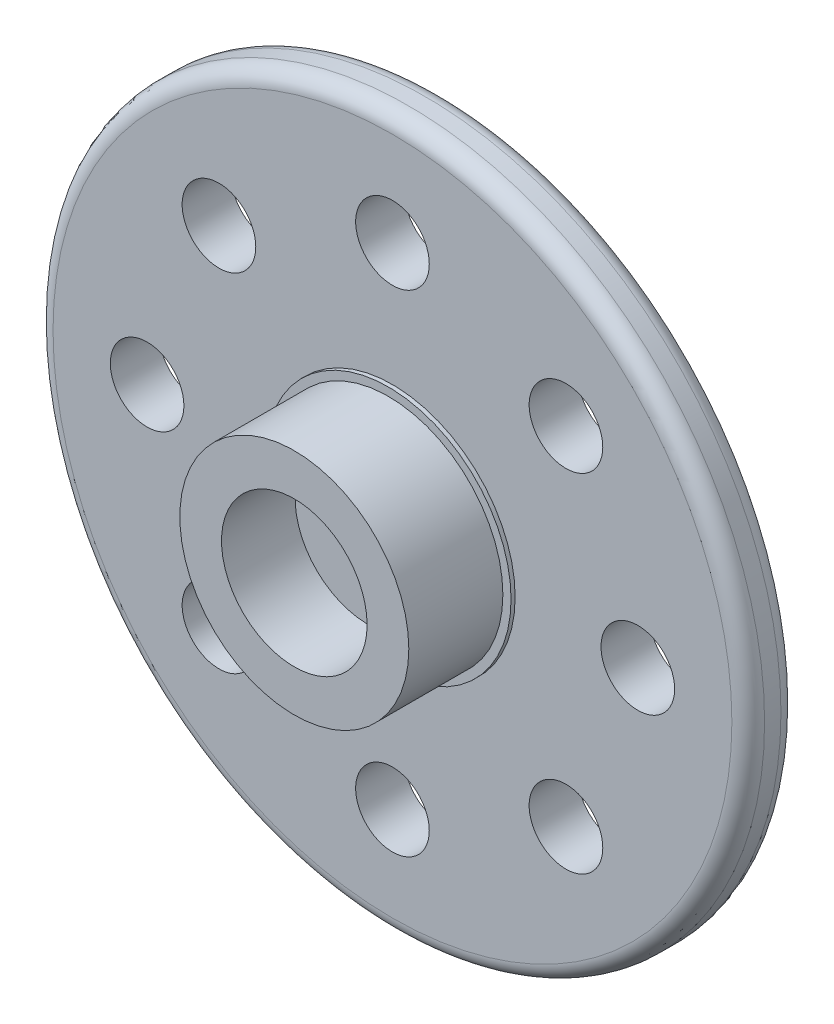
ISO-10303-21;
HEADER;
FILE_DESCRIPTION(('STEP AP214'),'2;1');
FILE_NAME('part.step','',(''),(''),'','','');
FILE_SCHEMA(('AUTOMOTIVE_DESIGN { 1 0 10303 214 1 1 1 1 }'));
ENDSEC;
DATA;
#1=APPLICATION_CONTEXT('core data for automotive mechanical design processes');
#2=APPLICATION_PROTOCOL_DEFINITION('international standard','automotive_design',2000,#1);
#3=PRODUCT_CONTEXT('',#1,'mechanical');
#4=PRODUCT('Part','Part','',(#3));
#5=PRODUCT_RELATED_PRODUCT_CATEGORY('part','',(#4));
#6=PRODUCT_DEFINITION_FORMATION('','',#4);
#7=PRODUCT_DEFINITION_CONTEXT('part definition',#1,'design');
#8=PRODUCT_DEFINITION('design','',#6,#7);
#9=PRODUCT_DEFINITION_SHAPE('','',#8);
#10=(LENGTH_UNIT() NAMED_UNIT(*) SI_UNIT(.MILLI.,.METRE.));
#11=(NAMED_UNIT(*) PLANE_ANGLE_UNIT() SI_UNIT($,.RADIAN.));
#12=(NAMED_UNIT(*) SI_UNIT($,.STERADIAN.) SOLID_ANGLE_UNIT());
#13=UNCERTAINTY_MEASURE_WITH_UNIT(LENGTH_MEASURE(1.E-05),#10,'distance_accuracy_value','');
#14=(GEOMETRIC_REPRESENTATION_CONTEXT(3) GLOBAL_UNCERTAINTY_ASSIGNED_CONTEXT((#13)) GLOBAL_UNIT_ASSIGNED_CONTEXT((#10,
#11,#12)) REPRESENTATION_CONTEXT('',''));
#15=CARTESIAN_POINT('',(0.,0.,0.));
#16=DIRECTION('',(0.,0.,1.));
#17=DIRECTION('',(1.,0.,0.));
#18=AXIS2_PLACEMENT_3D('',#15,#16,#17);
#19=CARTESIAN_POINT('',(0.,0.,24.0767275017666));
#20=DIRECTION('',(0.,0.,-1.));
#21=DIRECTION('',(-1.,0.,0.));
#22=AXIS2_PLACEMENT_3D('',#19,#20,#21);
#23=CYLINDRICAL_SURFACE('',#22,21.75);
#24=CARTESIAN_POINT('',(0.,0.,22.0767275017666));
#25=DIRECTION('',(0.,0.,1.));
#26=DIRECTION('',(1.,0.,0.));
#27=AXIS2_PLACEMENT_3D('',#24,#25,#26);
#28=CIRCLE('',#27,21.75);
#29=CARTESIAN_POINT('',(21.75,0.,22.0767275017666));
#30=VERTEX_POINT('',#29);
#31=EDGE_CURVE('E43',#30,#30,#28,.T.);
#32=ORIENTED_EDGE('',*,*,#31,.T.);
#33=EDGE_LOOP('',(#32));
#34=FACE_BOUND('',#33,.T.);
#35=CARTESIAN_POINT('',(0.,0.,23.0767275017666));
#36=DIRECTION('',(0.,0.,1.));
#37=DIRECTION('',(1.,0.,0.));
#38=AXIS2_PLACEMENT_3D('',#35,#36,#37);
#39=CIRCLE('',#38,21.75);
#40=CARTESIAN_POINT('',(21.75,0.,23.0767275017666));
#41=VERTEX_POINT('',#40);
#42=EDGE_CURVE('E47',#41,#41,#39,.F.);
#43=ORIENTED_EDGE('',*,*,#42,.T.);
#44=EDGE_LOOP('',(#43));
#45=FACE_BOUND('',#44,.T.);
#46=ADVANCED_FACE('F32',(#34,#45),#23,.T.);
#47=CARTESIAN_POINT('',(0.,0.,24.0767275017666));
#48=DIRECTION('',(0.,0.,1.));
#49=DIRECTION('',(1.,0.,0.));
#50=AXIS2_PLACEMENT_3D('',#47,#48,#49);
#51=PLANE('',#50);
#52=CARTESIAN_POINT('',(0.,0.,24.0767275017666));
#53=DIRECTION('',(0.,0.,1.));
#54=DIRECTION('',(1.,0.,0.));
#55=AXIS2_PLACEMENT_3D('',#52,#53,#54);
#56=CIRCLE('',#55,20.75);
#57=CARTESIAN_POINT('',(20.75,0.,24.0767275017666));
#58=VERTEX_POINT('',#57);
#59=EDGE_CURVE('E10',#58,#58,#56,.T.);
#60=ORIENTED_EDGE('',*,*,#59,.T.);
#61=EDGE_LOOP('',(#60));
#62=FACE_BOUND('',#61,.T.);
#63=CARTESIAN_POINT('',(-10.6066017177981,10.6066017177981,24.0767275017666));
#64=DIRECTION('',(0.,0.,1.));
#65=DIRECTION('',(1.,0.,0.));
#66=AXIS2_PLACEMENT_3D('',#63,#64,#65);
#67=CIRCLE('',#66,2.25);
#68=CARTESIAN_POINT('',(-8.35660171779812,10.6066017177981,24.0767275017666));
#69=VERTEX_POINT('',#68);
#70=EDGE_CURVE('E75',#69,#69,#67,.T.);
#71=ORIENTED_EDGE('',*,*,#70,.F.);
#72=EDGE_LOOP('',(#71));
#73=FACE_BOUND('',#72,.T.);
#74=CARTESIAN_POINT('',(-15.,0.,24.0767275017666));
#75=DIRECTION('',(0.,0.,1.));
#76=DIRECTION('',(1.,0.,0.));
#77=AXIS2_PLACEMENT_3D('',#74,#75,#76);
#78=CIRCLE('',#77,2.25);
#79=CARTESIAN_POINT('',(-12.75,0.,24.0767275017666));
#80=VERTEX_POINT('',#79);
#81=EDGE_CURVE('E74',#80,#80,#78,.T.);
#82=ORIENTED_EDGE('',*,*,#81,.F.);
#83=EDGE_LOOP('',(#82));
#84=FACE_BOUND('',#83,.T.);
#85=CARTESIAN_POINT('',(-10.6066017177981,-10.6066017177981,24.0767275017666));
#86=DIRECTION('',(0.,0.,1.));
#87=DIRECTION('',(1.,0.,0.));
#88=AXIS2_PLACEMENT_3D('',#85,#86,#87);
#89=CIRCLE('',#88,2.25);
#90=CARTESIAN_POINT('',(-8.35660171779811,-10.6066017177981,24.0767275017666));
#91=VERTEX_POINT('',#90);
#92=EDGE_CURVE('E82',#91,#91,#89,.T.);
#93=ORIENTED_EDGE('',*,*,#92,.F.);
#94=EDGE_LOOP('',(#93));
#95=FACE_BOUND('',#94,.T.);
#96=CARTESIAN_POINT('',(0.,-15.,24.0767275017666));
#97=DIRECTION('',(0.,0.,1.));
#98=DIRECTION('',(1.,0.,0.));
#99=AXIS2_PLACEMENT_3D('',#96,#97,#98);
#100=CIRCLE('',#99,2.25);
#101=CARTESIAN_POINT('',(2.25,-15.,24.0767275017666));
#102=VERTEX_POINT('',#101);
#103=EDGE_CURVE('E88',#102,#102,#100,.T.);
#104=ORIENTED_EDGE('',*,*,#103,.F.);
#105=EDGE_LOOP('',(#104));
#106=FACE_BOUND('',#105,.T.);
#107=CARTESIAN_POINT('',(10.6066017177981,-10.6066017177981,24.0767275017666));
#108=DIRECTION('',(0.,0.,1.));
#109=DIRECTION('',(1.,0.,0.));
#110=AXIS2_PLACEMENT_3D('',#107,#108,#109);
#111=CIRCLE('',#110,2.25);
#112=CARTESIAN_POINT('',(12.8566017177981,-10.6066017177981,24.0767275017666));
#113=VERTEX_POINT('',#112);
#114=EDGE_CURVE('E94',#113,#113,#111,.T.);
#115=ORIENTED_EDGE('',*,*,#114,.F.);
#116=EDGE_LOOP('',(#115));
#117=FACE_BOUND('',#116,.T.);
#118=CARTESIAN_POINT('',(15.,0.,24.0767275017666));
#119=DIRECTION('',(0.,0.,1.));
#120=DIRECTION('',(1.,0.,0.));
#121=AXIS2_PLACEMENT_3D('',#118,#119,#120);
#122=CIRCLE('',#121,2.25);
#123=CARTESIAN_POINT('',(17.25,0.,24.0767275017666));
#124=VERTEX_POINT('',#123);
#125=EDGE_CURVE('E100',#124,#124,#122,.T.);
#126=ORIENTED_EDGE('',*,*,#125,.F.);
#127=EDGE_LOOP('',(#126));
#128=FACE_BOUND('',#127,.T.);
#129=CARTESIAN_POINT('',(10.6066017177981,10.6066017177981,24.0767275017666));
#130=DIRECTION('',(0.,0.,1.));
#131=DIRECTION('',(1.,0.,0.));
#132=AXIS2_PLACEMENT_3D('',#129,#130,#131);
#133=CIRCLE('',#132,2.24999999999999);
#134=CARTESIAN_POINT('',(12.8566017177981,10.6066017177981,24.0767275017666));
#135=VERTEX_POINT('',#134);
#136=EDGE_CURVE('E106',#135,#135,#133,.T.);
#137=ORIENTED_EDGE('',*,*,#136,.F.);
#138=EDGE_LOOP('',(#137));
#139=FACE_BOUND('',#138,.T.);
#140=CARTESIAN_POINT('',(0.,15.,24.0767275017666));
#141=DIRECTION('',(0.,0.,1.));
#142=DIRECTION('',(1.,0.,0.));
#143=AXIS2_PLACEMENT_3D('',#140,#141,#142);
#144=CIRCLE('',#143,2.25);
#145=CARTESIAN_POINT('',(2.25,15.,24.0767275017666));
#146=VERTEX_POINT('',#145);
#147=EDGE_CURVE('E67',#146,#146,#144,.T.);
#148=ORIENTED_EDGE('',*,*,#147,.F.);
#149=EDGE_LOOP('',(#148));
#150=FACE_BOUND('',#149,.T.);
#151=CARTESIAN_POINT('',(0.,0.,24.0767275017666));
#152=DIRECTION('',(0.,0.,1.));
#153=DIRECTION('',(1.,0.,0.));
#154=AXIS2_PLACEMENT_3D('',#151,#152,#153);
#155=CIRCLE('',#154,7.5);
#156=CARTESIAN_POINT('',(7.5,0.,24.0767275017666));
#157=VERTEX_POINT('',#156);
#158=EDGE_CURVE('E53',#157,#157,#155,.T.);
#159=ORIENTED_EDGE('',*,*,#158,.F.);
#160=EDGE_LOOP('',(#159));
#161=FACE_BOUND('',#160,.T.);
#162=ADVANCED_FACE('F153',(#62,#73,#84,#95,#106,#117,#128,#139,#150,#161),#51,.T.);
#163=CARTESIAN_POINT('',(0.,0.,21.0767275017666));
#164=DIRECTION('',(0.,0.,1.));
#165=DIRECTION('',(1.,0.,0.));
#166=AXIS2_PLACEMENT_3D('',#163,#164,#165);
#167=PLANE('',#166);
#168=CARTESIAN_POINT('',(0.,0.,21.0767275017666));
#169=DIRECTION('',(0.,0.,1.));
#170=DIRECTION('',(1.,0.,0.));
#171=AXIS2_PLACEMENT_3D('',#168,#169,#170);
#172=CIRCLE('',#171,20.75);
#173=CARTESIAN_POINT('',(20.75,0.,21.0767275017666));
#174=VERTEX_POINT('',#173);
#175=EDGE_CURVE('E39',#174,#174,#172,.F.);
#176=ORIENTED_EDGE('',*,*,#175,.T.);
#177=EDGE_LOOP('',(#176));
#178=FACE_BOUND('',#177,.T.);
#179=CARTESIAN_POINT('',(-10.6066017177981,10.6066017177981,21.0767275017666));
#180=DIRECTION('',(0.,0.,1.));
#181=DIRECTION('',(1.,0.,0.));
#182=AXIS2_PLACEMENT_3D('',#179,#180,#181);
#183=CIRCLE('',#182,2.25);
#184=CARTESIAN_POINT('',(-8.35660171779812,10.6066017177981,21.0767275017666));
#185=VERTEX_POINT('',#184);
#186=EDGE_CURVE('E71',#185,#185,#183,.F.);
#187=ORIENTED_EDGE('',*,*,#186,.F.);
#188=EDGE_LOOP('',(#187));
#189=FACE_BOUND('',#188,.T.);
#190=CARTESIAN_POINT('',(-15.,0.,21.0767275017666));
#191=DIRECTION('',(0.,0.,1.));
#192=DIRECTION('',(1.,0.,0.));
#193=AXIS2_PLACEMENT_3D('',#190,#191,#192);
#194=CIRCLE('',#193,2.25);
#195=CARTESIAN_POINT('',(-12.75,0.,21.0767275017666));
#196=VERTEX_POINT('',#195);
#197=EDGE_CURVE('E79',#196,#196,#194,.F.);
#198=ORIENTED_EDGE('',*,*,#197,.F.);
#199=EDGE_LOOP('',(#198));
#200=FACE_BOUND('',#199,.T.);
#201=CARTESIAN_POINT('',(-10.6066017177981,-10.6066017177981,21.0767275017666));
#202=DIRECTION('',(0.,0.,1.));
#203=DIRECTION('',(1.,0.,0.));
#204=AXIS2_PLACEMENT_3D('',#201,#202,#203);
#205=CIRCLE('',#204,2.25);
#206=CARTESIAN_POINT('',(-8.35660171779811,-10.6066017177981,21.0767275017666));
#207=VERTEX_POINT('',#206);
#208=EDGE_CURVE('E85',#207,#207,#205,.F.);
#209=ORIENTED_EDGE('',*,*,#208,.F.);
#210=EDGE_LOOP('',(#209));
#211=FACE_BOUND('',#210,.T.);
#212=CARTESIAN_POINT('',(0.,-15.,21.0767275017666));
#213=DIRECTION('',(0.,0.,1.));
#214=DIRECTION('',(1.,0.,0.));
#215=AXIS2_PLACEMENT_3D('',#212,#213,#214);
#216=CIRCLE('',#215,2.25);
#217=CARTESIAN_POINT('',(2.25,-15.,21.0767275017666));
#218=VERTEX_POINT('',#217);
#219=EDGE_CURVE('E91',#218,#218,#216,.F.);
#220=ORIENTED_EDGE('',*,*,#219,.F.);
#221=EDGE_LOOP('',(#220));
#222=FACE_BOUND('',#221,.T.);
#223=CARTESIAN_POINT('',(10.6066017177981,-10.6066017177981,21.0767275017666));
#224=DIRECTION('',(0.,0.,1.));
#225=DIRECTION('',(1.,0.,0.));
#226=AXIS2_PLACEMENT_3D('',#223,#224,#225);
#227=CIRCLE('',#226,2.25);
#228=CARTESIAN_POINT('',(12.8566017177981,-10.6066017177981,21.0767275017666));
#229=VERTEX_POINT('',#228);
#230=EDGE_CURVE('E97',#229,#229,#227,.F.);
#231=ORIENTED_EDGE('',*,*,#230,.F.);
#232=EDGE_LOOP('',(#231));
#233=FACE_BOUND('',#232,.T.);
#234=CARTESIAN_POINT('',(15.,0.,21.0767275017666));
#235=DIRECTION('',(0.,0.,1.));
#236=DIRECTION('',(1.,0.,0.));
#237=AXIS2_PLACEMENT_3D('',#234,#235,#236);
#238=CIRCLE('',#237,2.25);
#239=CARTESIAN_POINT('',(17.25,0.,21.0767275017666));
#240=VERTEX_POINT('',#239);
#241=EDGE_CURVE('E103',#240,#240,#238,.F.);
#242=ORIENTED_EDGE('',*,*,#241,.F.);
#243=EDGE_LOOP('',(#242));
#244=FACE_BOUND('',#243,.T.);
#245=CARTESIAN_POINT('',(10.6066017177981,10.6066017177981,21.0767275017666));
#246=DIRECTION('',(0.,0.,1.));
#247=DIRECTION('',(1.,0.,0.));
#248=AXIS2_PLACEMENT_3D('',#245,#246,#247);
#249=CIRCLE('',#248,2.24999999999999);
#250=CARTESIAN_POINT('',(12.8566017177981,10.6066017177981,21.0767275017666));
#251=VERTEX_POINT('',#250);
#252=EDGE_CURVE('E70',#251,#251,#249,.F.);
#253=ORIENTED_EDGE('',*,*,#252,.F.);
#254=EDGE_LOOP('',(#253));
#255=FACE_BOUND('',#254,.T.);
#256=CARTESIAN_POINT('',(0.,15.,21.0767275017666));
#257=DIRECTION('',(0.,0.,1.));
#258=DIRECTION('',(1.,0.,0.));
#259=AXIS2_PLACEMENT_3D('',#256,#257,#258);
#260=CIRCLE('',#259,2.25);
#261=CARTESIAN_POINT('',(2.25,15.,21.0767275017666));
#262=VERTEX_POINT('',#261);
#263=EDGE_CURVE('E64',#262,#262,#260,.F.);
#264=ORIENTED_EDGE('',*,*,#263,.F.);
#265=EDGE_LOOP('',(#264));
#266=FACE_BOUND('',#265,.T.);
#267=ADVANCED_FACE('F149',(#178,#189,#200,#211,#222,#233,#244,#255,#266),#167,.F.);
#268=CARTESIAN_POINT('',(0.,0.,24.3267275017666));
#269=DIRECTION('',(0.,0.,-1.));
#270=DIRECTION('',(-1.,0.,0.));
#271=AXIS2_PLACEMENT_3D('',#268,#269,#270);
#272=CYLINDRICAL_SURFACE('',#271,7.5);
#273=CARTESIAN_POINT('',(0.,0.,24.3267275017666));
#274=DIRECTION('',(0.,0.,1.));
#275=DIRECTION('',(1.,0.,0.));
#276=AXIS2_PLACEMENT_3D('',#273,#274,#275);
#277=CIRCLE('',#276,7.5);
#278=CARTESIAN_POINT('',(7.5,0.,24.3267275017666));
#279=VERTEX_POINT('',#278);
#280=EDGE_CURVE('E56',#279,#279,#277,.T.);
#281=ORIENTED_EDGE('',*,*,#280,.F.);
#282=EDGE_LOOP('',(#281));
#283=FACE_BOUND('',#282,.T.);
#284=ORIENTED_EDGE('',*,*,#158,.T.);
#285=EDGE_LOOP('',(#284));
#286=FACE_BOUND('',#285,.T.);
#287=ADVANCED_FACE('F143',(#283,#286),#272,.T.);
#288=CARTESIAN_POINT('',(0.,0.,24.3267275017666));
#289=DIRECTION('',(0.,0.,1.));
#290=DIRECTION('',(1.,0.,0.));
#291=AXIS2_PLACEMENT_3D('',#288,#289,#290);
#292=PLANE('',#291);
#293=CARTESIAN_POINT('',(0.,0.,24.3267275017666));
#294=DIRECTION('',(0.,0.,1.));
#295=DIRECTION('',(1.,0.,0.));
#296=AXIS2_PLACEMENT_3D('',#293,#294,#295);
#297=CIRCLE('',#296,7.);
#298=CARTESIAN_POINT('',(7.,0.,24.3267275017666));
#299=VERTEX_POINT('',#298);
#300=EDGE_CURVE('E52',#299,#299,#297,.T.);
#301=ORIENTED_EDGE('',*,*,#300,.F.);
#302=EDGE_LOOP('',(#301));
#303=FACE_BOUND('',#302,.T.);
#304=ORIENTED_EDGE('',*,*,#280,.T.);
#305=EDGE_LOOP('',(#304));
#306=FACE_BOUND('',#305,.T.);
#307=ADVANCED_FACE('F137',(#303,#306),#292,.T.);
#308=CARTESIAN_POINT('',(0.,0.,30.0767275017666));
#309=DIRECTION('',(0.,0.,-1.));
#310=DIRECTION('',(-1.,0.,0.));
#311=AXIS2_PLACEMENT_3D('',#308,#309,#310);
#312=CYLINDRICAL_SURFACE('',#311,7.);
#313=CARTESIAN_POINT('',(0.,0.,30.0767275017666));
#314=DIRECTION('',(0.,0.,1.));
#315=DIRECTION('',(1.,0.,0.));
#316=AXIS2_PLACEMENT_3D('',#313,#314,#315);
#317=CIRCLE('',#316,7.);
#318=CARTESIAN_POINT('',(7.,0.,30.0767275017666));
#319=VERTEX_POINT('',#318);
#320=EDGE_CURVE('E59',#319,#319,#317,.T.);
#321=ORIENTED_EDGE('',*,*,#320,.F.);
#322=EDGE_LOOP('',(#321));
#323=FACE_BOUND('',#322,.T.);
#324=ORIENTED_EDGE('',*,*,#300,.T.);
#325=EDGE_LOOP('',(#324));
#326=FACE_BOUND('',#325,.T.);
#327=ADVANCED_FACE('F131',(#323,#326),#312,.T.);
#328=CARTESIAN_POINT('',(0.,0.,30.0767275017666));
#329=DIRECTION('',(0.,0.,1.));
#330=DIRECTION('',(1.,0.,0.));
#331=AXIS2_PLACEMENT_3D('',#328,#329,#330);
#332=PLANE('',#331);
#333=CARTESIAN_POINT('',(0.,0.,30.0767275017666));
#334=DIRECTION('',(0.,0.,1.));
#335=DIRECTION('',(1.,0.,0.));
#336=AXIS2_PLACEMENT_3D('',#333,#334,#335);
#337=CIRCLE('',#336,4.45);
#338=CARTESIAN_POINT('',(4.45,0.,30.0767275017666));
#339=VERTEX_POINT('',#338);
#340=EDGE_CURVE('E113',#339,#339,#337,.T.);
#341=ORIENTED_EDGE('',*,*,#340,.F.);
#342=EDGE_LOOP('',(#341));
#343=FACE_BOUND('',#342,.T.);
#344=ORIENTED_EDGE('',*,*,#320,.T.);
#345=EDGE_LOOP('',(#344));
#346=FACE_BOUND('',#345,.T.);
#347=ADVANCED_FACE('F127',(#343,#346),#332,.T.);
#348=CARTESIAN_POINT('',(0.,15.,14.7127664710877));
#349=DIRECTION('',(0.,0.,1.));
#350=DIRECTION('',(1.,0.,0.));
#351=AXIS2_PLACEMENT_3D('',#348,#349,#350);
#352=CYLINDRICAL_SURFACE('',#351,2.25);
#353=ORIENTED_EDGE('',*,*,#263,.T.);
#354=EDGE_LOOP('',(#353));
#355=FACE_BOUND('',#354,.T.);
#356=ORIENTED_EDGE('',*,*,#147,.T.);
#357=EDGE_LOOP('',(#356));
#358=FACE_BOUND('',#357,.T.);
#359=ADVANCED_FACE('F130',(#355,#358),#352,.F.);
#360=CARTESIAN_POINT('',(10.6066017177981,10.6066017177981,14.7127664710877));
#361=DIRECTION('',(0.,0.,1.));
#362=DIRECTION('',(1.,0.,0.));
#363=AXIS2_PLACEMENT_3D('',#360,#361,#362);
#364=CYLINDRICAL_SURFACE('',#363,2.24999999999999);
#365=ORIENTED_EDGE('',*,*,#252,.T.);
#366=EDGE_LOOP('',(#365));
#367=FACE_BOUND('',#366,.T.);
#368=ORIENTED_EDGE('',*,*,#136,.T.);
#369=EDGE_LOOP('',(#368));
#370=FACE_BOUND('',#369,.T.);
#371=ADVANCED_FACE('F191',(#367,#370),#364,.F.);
#372=CARTESIAN_POINT('',(15.,0.,14.7127664710877));
#373=DIRECTION('',(0.,0.,1.));
#374=DIRECTION('',(1.,0.,0.));
#375=AXIS2_PLACEMENT_3D('',#372,#373,#374);
#376=CYLINDRICAL_SURFACE('',#375,2.25);
#377=ORIENTED_EDGE('',*,*,#241,.T.);
#378=EDGE_LOOP('',(#377));
#379=FACE_BOUND('',#378,.T.);
#380=ORIENTED_EDGE('',*,*,#125,.T.);
#381=EDGE_LOOP('',(#380));
#382=FACE_BOUND('',#381,.T.);
#383=ADVANCED_FACE('F196',(#379,#382),#376,.F.);
#384=CARTESIAN_POINT('',(10.6066017177981,-10.6066017177981,14.7127664710877));
#385=DIRECTION('',(0.,0.,1.));
#386=DIRECTION('',(1.,0.,0.));
#387=AXIS2_PLACEMENT_3D('',#384,#385,#386);
#388=CYLINDRICAL_SURFACE('',#387,2.25);
#389=ORIENTED_EDGE('',*,*,#230,.T.);
#390=EDGE_LOOP('',(#389));
#391=FACE_BOUND('',#390,.T.);
#392=ORIENTED_EDGE('',*,*,#114,.T.);
#393=EDGE_LOOP('',(#392));
#394=FACE_BOUND('',#393,.T.);
#395=ADVANCED_FACE('F207',(#391,#394),#388,.F.);
#396=CARTESIAN_POINT('',(0.,-15.,14.7127664710877));
#397=DIRECTION('',(0.,0.,1.));
#398=DIRECTION('',(1.,0.,0.));
#399=AXIS2_PLACEMENT_3D('',#396,#397,#398);
#400=CYLINDRICAL_SURFACE('',#399,2.25);
#401=ORIENTED_EDGE('',*,*,#219,.T.);
#402=EDGE_LOOP('',(#401));
#403=FACE_BOUND('',#402,.T.);
#404=ORIENTED_EDGE('',*,*,#103,.T.);
#405=EDGE_LOOP('',(#404));
#406=FACE_BOUND('',#405,.T.);
#407=ADVANCED_FACE('F215',(#403,#406),#400,.F.);
#408=CARTESIAN_POINT('',(-10.6066017177981,-10.6066017177981,14.7127664710877));
#409=DIRECTION('',(0.,0.,1.));
#410=DIRECTION('',(1.,0.,0.));
#411=AXIS2_PLACEMENT_3D('',#408,#409,#410);
#412=CYLINDRICAL_SURFACE('',#411,2.25);
#413=ORIENTED_EDGE('',*,*,#208,.T.);
#414=EDGE_LOOP('',(#413));
#415=FACE_BOUND('',#414,.T.);
#416=ORIENTED_EDGE('',*,*,#92,.T.);
#417=EDGE_LOOP('',(#416));
#418=FACE_BOUND('',#417,.T.);
#419=ADVANCED_FACE('F184',(#415,#418),#412,.F.);
#420=CARTESIAN_POINT('',(-15.,0.,14.7127664710877));
#421=DIRECTION('',(0.,0.,1.));
#422=DIRECTION('',(1.,0.,0.));
#423=AXIS2_PLACEMENT_3D('',#420,#421,#422);
#424=CYLINDRICAL_SURFACE('',#423,2.25);
#425=ORIENTED_EDGE('',*,*,#197,.T.);
#426=EDGE_LOOP('',(#425));
#427=FACE_BOUND('',#426,.T.);
#428=ORIENTED_EDGE('',*,*,#81,.T.);
#429=EDGE_LOOP('',(#428));
#430=FACE_BOUND('',#429,.T.);
#431=ADVANCED_FACE('F173',(#427,#430),#424,.F.);
#432=CARTESIAN_POINT('',(-10.6066017177981,10.6066017177981,14.7127664710877));
#433=DIRECTION('',(0.,0.,1.));
#434=DIRECTION('',(1.,0.,0.));
#435=AXIS2_PLACEMENT_3D('',#432,#433,#434);
#436=CYLINDRICAL_SURFACE('',#435,2.25);
#437=ORIENTED_EDGE('',*,*,#186,.T.);
#438=EDGE_LOOP('',(#437));
#439=FACE_BOUND('',#438,.T.);
#440=ORIENTED_EDGE('',*,*,#70,.T.);
#441=EDGE_LOOP('',(#440));
#442=FACE_BOUND('',#441,.T.);
#443=ADVANCED_FACE('F166',(#439,#442),#436,.F.);
#444=CARTESIAN_POINT('',(0.,0.,22.0767275017666));
#445=DIRECTION('',(0.,0.,1.));
#446=DIRECTION('',(1.,0.,0.));
#447=AXIS2_PLACEMENT_3D('',#444,#445,#446);
#448=TOROIDAL_SURFACE('',#447,20.75,1.);
#449=ORIENTED_EDGE('',*,*,#175,.F.);
#450=EDGE_LOOP('',(#449));
#451=FACE_BOUND('',#450,.T.);
#452=ORIENTED_EDGE('',*,*,#31,.F.);
#453=EDGE_LOOP('',(#452));
#454=FACE_BOUND('',#453,.T.);
#455=ADVANCED_FACE('F164',(#451,#454),#448,.T.);
#456=CARTESIAN_POINT('',(0.,0.,23.0767275017666));
#457=DIRECTION('',(0.,0.,1.));
#458=DIRECTION('',(1.,0.,0.));
#459=AXIS2_PLACEMENT_3D('',#456,#457,#458);
#460=TOROIDAL_SURFACE('',#459,20.75,1.);
#461=ORIENTED_EDGE('',*,*,#42,.F.);
#462=EDGE_LOOP('',(#461));
#463=FACE_BOUND('',#462,.T.);
#464=ORIENTED_EDGE('',*,*,#59,.F.);
#465=EDGE_LOOP('',(#464));
#466=FACE_BOUND('',#465,.T.);
#467=ADVANCED_FACE('F34',(#463,#466),#460,.T.);
#468=CARTESIAN_POINT('',(0.,0.,25.5767275017666));
#469=DIRECTION('',(0.,0.,1.));
#470=DIRECTION('',(1.,0.,0.));
#471=AXIS2_PLACEMENT_3D('',#468,#469,#470);
#472=CYLINDRICAL_SURFACE('',#471,4.45);
#473=CARTESIAN_POINT('',(0.,0.,25.5767275017666));
#474=DIRECTION('',(0.,0.,1.));
#475=DIRECTION('',(1.,0.,0.));
#476=AXIS2_PLACEMENT_3D('',#473,#474,#475);
#477=CIRCLE('',#476,4.45);
#478=CARTESIAN_POINT('',(4.45,0.,25.5767275017666));
#479=VERTEX_POINT('',#478);
#480=EDGE_CURVE('E78',#479,#479,#477,.T.);
#481=ORIENTED_EDGE('',*,*,#480,.F.);
#482=EDGE_LOOP('',(#481));
#483=FACE_BOUND('',#482,.T.);
#484=ORIENTED_EDGE('',*,*,#340,.T.);
#485=EDGE_LOOP('',(#484));
#486=FACE_BOUND('',#485,.T.);
#487=ADVANCED_FACE('F121',(#483,#486),#472,.F.);
#488=CARTESIAN_POINT('',(0.,0.,25.5767275017666));
#489=DIRECTION('',(0.,0.,1.));
#490=DIRECTION('',(1.,0.,0.));
#491=AXIS2_PLACEMENT_3D('',#488,#489,#490);
#492=PLANE('',#491);
#493=ORIENTED_EDGE('',*,*,#480,.T.);
#494=EDGE_LOOP('',(#493));
#495=FACE_BOUND('',#494,.T.);
#496=ADVANCED_FACE('F119',(#495),#492,.T.);
#497=CLOSED_SHELL('',(#46,#162,#267,#287,#307,#327,#347,#359,#371,#383,#395,#407,#419,#431,#443,
#455,#467,#487,#496));
#498=MANIFOLD_SOLID_BREP('B2',#497);
#499=ADVANCED_BREP_SHAPE_REPRESENTATION('',(#18,#498),#14);
#500=SHAPE_DEFINITION_REPRESENTATION(#9,#499);
ENDSEC;
END-ISO-10303-21;
